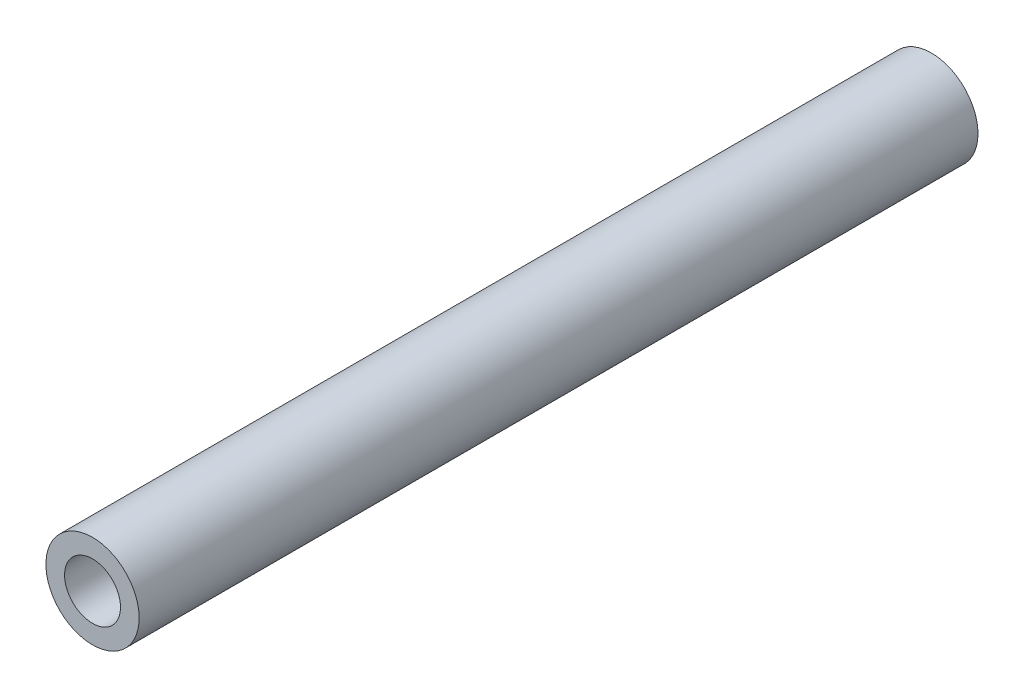
ISO-10303-21;
HEADER;
FILE_DESCRIPTION(('STEP AP214'),'2;1');
FILE_NAME('part.step','',(''),(''),'','','');
FILE_SCHEMA(('AUTOMOTIVE_DESIGN { 1 0 10303 214 1 1 1 1 }'));
ENDSEC;
DATA;
#1=APPLICATION_CONTEXT('core data for automotive mechanical design processes');
#2=APPLICATION_PROTOCOL_DEFINITION('international standard','automotive_design',2000,#1);
#3=PRODUCT_CONTEXT('',#1,'mechanical');
#4=PRODUCT('Part','Part','',(#3));
#5=PRODUCT_RELATED_PRODUCT_CATEGORY('part','',(#4));
#6=PRODUCT_DEFINITION_FORMATION('','',#4);
#7=PRODUCT_DEFINITION_CONTEXT('part definition',#1,'design');
#8=PRODUCT_DEFINITION('design','',#6,#7);
#9=PRODUCT_DEFINITION_SHAPE('','',#8);
#10=(LENGTH_UNIT() NAMED_UNIT(*) SI_UNIT(.MILLI.,.METRE.));
#11=(NAMED_UNIT(*) PLANE_ANGLE_UNIT() SI_UNIT($,.RADIAN.));
#12=(NAMED_UNIT(*) SI_UNIT($,.STERADIAN.) SOLID_ANGLE_UNIT());
#13=UNCERTAINTY_MEASURE_WITH_UNIT(LENGTH_MEASURE(1.E-05),#10,'distance_accuracy_value','');
#14=(GEOMETRIC_REPRESENTATION_CONTEXT(3) GLOBAL_UNCERTAINTY_ASSIGNED_CONTEXT((#13)) GLOBAL_UNIT_ASSIGNED_CONTEXT((#10,
#11,#12)) REPRESENTATION_CONTEXT('',''));
#15=CARTESIAN_POINT('',(0.,0.,0.));
#16=DIRECTION('',(0.,0.,1.));
#17=DIRECTION('',(1.,0.,0.));
#18=AXIS2_PLACEMENT_3D('',#15,#16,#17);
#19=CARTESIAN_POINT('',(0.,0.,22.5));
#20=DIRECTION('',(0.,0.,1.));
#21=DIRECTION('',(1.,0.,0.));
#22=AXIS2_PLACEMENT_3D('',#19,#20,#21);
#23=PLANE('',#22);
#24=CARTESIAN_POINT('',(0.,0.,22.5));
#25=DIRECTION('',(0.,0.,1.));
#26=DIRECTION('',(1.,0.,0.));
#27=AXIS2_PLACEMENT_3D('',#24,#25,#26);
#28=CIRCLE('',#27,2.5);
#29=CARTESIAN_POINT('',(2.5,0.,22.5));
#30=VERTEX_POINT('',#29);
#31=EDGE_CURVE('E10',#30,#30,#28,.T.);
#32=ORIENTED_EDGE('',*,*,#31,.T.);
#33=EDGE_LOOP('',(#32));
#34=FACE_BOUND('',#33,.T.);
#35=CARTESIAN_POINT('',(0.,0.,22.5));
#36=DIRECTION('',(0.,0.,1.));
#37=DIRECTION('',(1.,0.,0.));
#38=AXIS2_PLACEMENT_3D('',#35,#36,#37);
#39=CIRCLE('',#38,1.5);
#40=CARTESIAN_POINT('',(1.5,0.,22.5));
#41=VERTEX_POINT('',#40);
#42=EDGE_CURVE('E41',#41,#41,#39,.T.);
#43=ORIENTED_EDGE('',*,*,#42,.F.);
#44=EDGE_LOOP('',(#43));
#45=FACE_BOUND('',#44,.T.);
#46=ADVANCED_FACE('F30',(#34,#45),#23,.T.);
#47=CARTESIAN_POINT('',(0.,0.,-22.5));
#48=DIRECTION('',(0.,0.,1.));
#49=DIRECTION('',(1.,0.,0.));
#50=AXIS2_PLACEMENT_3D('',#47,#48,#49);
#51=PLANE('',#50);
#52=CARTESIAN_POINT('',(0.,0.,-22.5));
#53=DIRECTION('',(0.,0.,1.));
#54=DIRECTION('',(1.,0.,0.));
#55=AXIS2_PLACEMENT_3D('',#52,#53,#54);
#56=CIRCLE('',#55,2.5);
#57=CARTESIAN_POINT('',(2.5,0.,-22.5));
#58=VERTEX_POINT('',#57);
#59=EDGE_CURVE('E34',#58,#58,#56,.T.);
#60=ORIENTED_EDGE('',*,*,#59,.F.);
#61=EDGE_LOOP('',(#60));
#62=FACE_BOUND('',#61,.T.);
#63=CARTESIAN_POINT('',(0.,0.,-22.5));
#64=DIRECTION('',(0.,0.,1.));
#65=DIRECTION('',(1.,0.,0.));
#66=AXIS2_PLACEMENT_3D('',#63,#64,#65);
#67=CIRCLE('',#66,1.5);
#68=CARTESIAN_POINT('',(1.5,0.,-22.5));
#69=VERTEX_POINT('',#68);
#70=EDGE_CURVE('E43',#69,#69,#67,.T.);
#71=ORIENTED_EDGE('',*,*,#70,.T.);
#72=EDGE_LOOP('',(#71));
#73=FACE_BOUND('',#72,.T.);
#74=ADVANCED_FACE('F53',(#62,#73),#51,.F.);
#75=CARTESIAN_POINT('',(0.,0.,22.5));
#76=DIRECTION('',(0.,0.,-1.));
#77=DIRECTION('',(-1.,0.,0.));
#78=AXIS2_PLACEMENT_3D('',#75,#76,#77);
#79=CYLINDRICAL_SURFACE('',#78,2.5);
#80=ORIENTED_EDGE('',*,*,#31,.F.);
#81=EDGE_LOOP('',(#80));
#82=FACE_BOUND('',#81,.T.);
#83=ORIENTED_EDGE('',*,*,#59,.T.);
#84=EDGE_LOOP('',(#83));
#85=FACE_BOUND('',#84,.T.);
#86=ADVANCED_FACE('F32',(#82,#85),#79,.T.);
#87=CARTESIAN_POINT('',(0.,0.,22.5));
#88=DIRECTION('',(0.,0.,-1.));
#89=DIRECTION('',(-1.,0.,0.));
#90=AXIS2_PLACEMENT_3D('',#87,#88,#89);
#91=CYLINDRICAL_SURFACE('',#90,1.5);
#92=ORIENTED_EDGE('',*,*,#42,.T.);
#93=EDGE_LOOP('',(#92));
#94=FACE_BOUND('',#93,.T.);
#95=ORIENTED_EDGE('',*,*,#70,.F.);
#96=EDGE_LOOP('',(#95));
#97=FACE_BOUND('',#96,.T.);
#98=ADVANCED_FACE('F49',(#94,#97),#91,.F.);
#99=CLOSED_SHELL('',(#46,#74,#86,#98));
#100=MANIFOLD_SOLID_BREP('B2',#99);
#101=ADVANCED_BREP_SHAPE_REPRESENTATION('',(#18,#100),#14);
#102=SHAPE_DEFINITION_REPRESENTATION(#9,#101);
ENDSEC;
END-ISO-10303-21;
